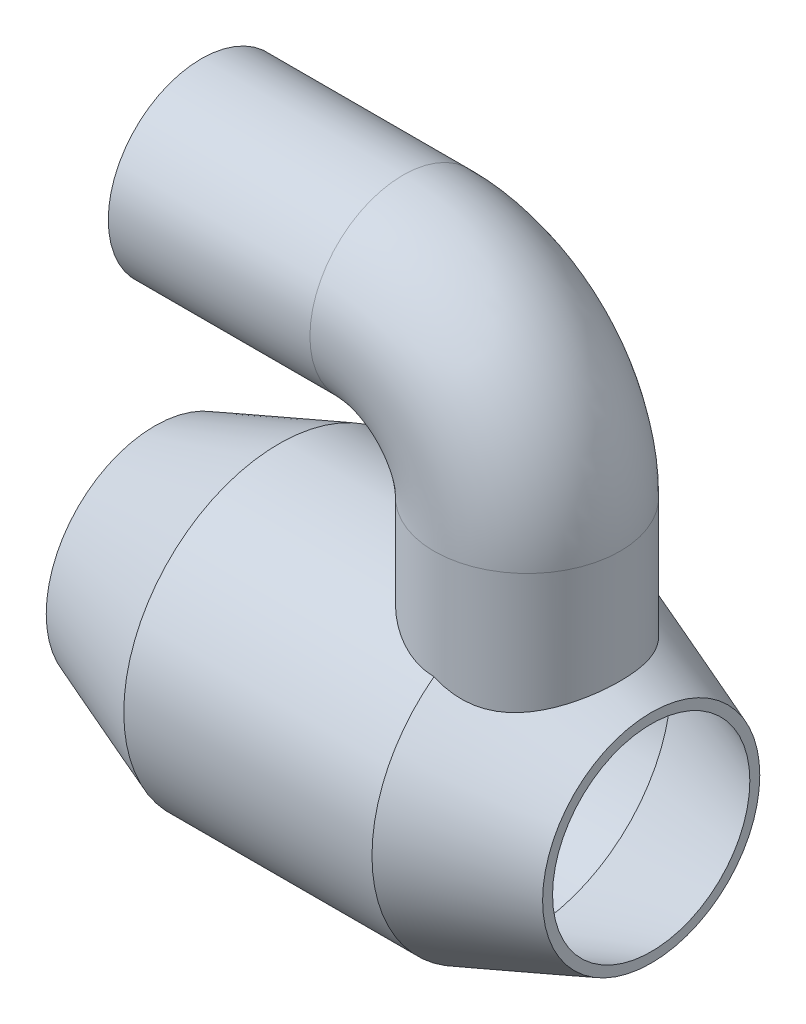
ISO-10303-21;
HEADER;
FILE_DESCRIPTION(('STEP AP214'),'2;1');
FILE_NAME('part.step','',(''),(''),'','','');
FILE_SCHEMA(('AUTOMOTIVE_DESIGN { 1 0 10303 214 1 1 1 1 }'));
ENDSEC;
DATA;
#1=APPLICATION_CONTEXT('core data for automotive mechanical design processes');
#2=APPLICATION_PROTOCOL_DEFINITION('international standard','automotive_design',2000,#1);
#3=PRODUCT_CONTEXT('',#1,'mechanical');
#4=PRODUCT('Part','Part','',(#3));
#5=PRODUCT_RELATED_PRODUCT_CATEGORY('part','',(#4));
#6=PRODUCT_DEFINITION_FORMATION('','',#4);
#7=PRODUCT_DEFINITION_CONTEXT('part definition',#1,'design');
#8=PRODUCT_DEFINITION('design','',#6,#7);
#9=PRODUCT_DEFINITION_SHAPE('','',#8);
#10=(LENGTH_UNIT() NAMED_UNIT(*) SI_UNIT(.MILLI.,.METRE.));
#11=(NAMED_UNIT(*) PLANE_ANGLE_UNIT() SI_UNIT($,.RADIAN.));
#12=(NAMED_UNIT(*) SI_UNIT($,.STERADIAN.) SOLID_ANGLE_UNIT());
#13=UNCERTAINTY_MEASURE_WITH_UNIT(LENGTH_MEASURE(1.E-05),#10,'distance_accuracy_value','');
#14=(GEOMETRIC_REPRESENTATION_CONTEXT(3) GLOBAL_UNCERTAINTY_ASSIGNED_CONTEXT((#13)) GLOBAL_UNIT_ASSIGNED_CONTEXT((#10,
#11,#12)) REPRESENTATION_CONTEXT('',''));
#15=CARTESIAN_POINT('',(0.,0.,0.));
#16=DIRECTION('',(0.,0.,1.));
#17=DIRECTION('',(1.,0.,0.));
#18=AXIS2_PLACEMENT_3D('',#15,#16,#17);
#19=CARTESIAN_POINT('',(80.,0.,0.));
#20=DIRECTION('',(-1.,0.,0.));
#21=DIRECTION('',(0.,0.,1.));
#22=AXIS2_PLACEMENT_3D('',#19,#20,#21);
#23=CONICAL_SURFACE('',#22,35.,0.358770670270572);
#24=CARTESIAN_POINT('',(80.,0.,0.));
#25=DIRECTION('',(-1.,0.,0.));
#26=DIRECTION('',(0.,0.,1.));
#27=AXIS2_PLACEMENT_3D('',#24,#25,#26);
#28=CIRCLE('',#27,35.);
#29=CARTESIAN_POINT('',(80.,0.,35.));
#30=VERTEX_POINT('',#29);
#31=EDGE_CURVE('E49',#30,#30,#28,.T.);
#32=ORIENTED_EDGE('',*,*,#31,.T.);
#33=EDGE_LOOP('',(#32));
#34=FACE_BOUND('',#33,.T.);
#35=CARTESIAN_POINT('',(39.9998,40.0000937504605,29.9999999993333));
#36=CARTESIAN_POINT('',(40.323096188011,39.8485477698529,29.9999991944932));
#37=CARTESIAN_POINT('',(40.6477604137894,39.6999696471568,29.9947776225283));
#38=CARTESIAN_POINT('',(41.2996605350347,39.4092535207293,29.9736103136749));
#39=CARTESIAN_POINT('',(41.626896759719,39.2671163577328,29.957663181064));
#40=CARTESIAN_POINT('',(42.6126358544597,38.8509507532919,29.8932757110898));
#41=CARTESIAN_POINT('',(43.2746309489505,38.5874219082275,29.8282883499882));
#42=CARTESIAN_POINT('',(44.6058325568533,38.0924319865128,29.651946151665));
#43=CARTESIAN_POINT('',(45.2750499752684,37.8610299606478,29.5405073999668));
#44=CARTESIAN_POINT('',(46.6152865375449,37.4349622340986,29.2695248885259));
#45=CARTESIAN_POINT('',(47.2863049729262,37.240283770188,29.109997892055));
#46=CARTESIAN_POINT('',(48.6296234591975,36.8896346125872,28.7405270941269));
#47=CARTESIAN_POINT('',(49.301903584151,36.7339232225839,28.5302629354244));
#48=CARTESIAN_POINT('',(50.6374411563098,36.4646829454509,28.0596878625612));
#49=CARTESIAN_POINT('',(51.3006978237388,36.3511576818737,27.7993726522073));
#50=CARTESIAN_POINT('',(52.6103437550198,36.1664983229699,27.2302747491758));
#51=CARTESIAN_POINT('',(53.256767354836,36.0952701997686,26.92160150474));
#52=CARTESIAN_POINT('',(54.5282283983598,35.9928331879588,26.25728538656));
#53=CARTESIAN_POINT('',(55.1532666788639,35.9616227317323,25.9016443532938));
#54=CARTESIAN_POINT('',(56.3320344732557,35.9364256172987,25.1735798443616));
#55=CARTESIAN_POINT('',(56.8876414618913,35.9398924890538,24.8042671435136));
#56=CARTESIAN_POINT('',(57.9724039540222,35.9740148011757,24.0299138530108));
#57=CARTESIAN_POINT('',(58.5015607067278,36.0046689562384,23.6248749531605));
#58=CARTESIAN_POINT('',(59.5313469305901,36.0886618185986,22.7809214280705));
#59=CARTESIAN_POINT('',(60.0319364030324,36.1420314882667,22.3419612372947));
#60=CARTESIAN_POINT('',(61.001734851296,36.2666412562169,21.4328925419033));
#61=CARTESIAN_POINT('',(61.4709399642187,36.3378835492173,20.9627802170962));
#62=CARTESIAN_POINT('',(62.1779475410738,36.4593523462047,20.2058818742253));
#63=CARTESIAN_POINT('',(62.427142062612,36.5051283184993,19.9289211527566));
#64=CARTESIAN_POINT('',(62.9147304315616,36.5999593892622,19.3663024593839));
#65=CARTESIAN_POINT('',(63.1531265387011,36.649013796301,19.0806463282392));
#66=CARTESIAN_POINT('',(63.8518805702837,36.7998967941208,18.2110080157486));
#67=CARTESIAN_POINT('',(64.2958139863507,36.9054469017289,17.6143454370342));
#68=CARTESIAN_POINT('',(65.1379396998891,37.1202866475325,16.3901248067506));
#69=CARTESIAN_POINT('',(65.5361224149791,37.2295770629286,15.7625603220245));
#70=CARTESIAN_POINT('',(66.2849894020835,37.4462724745604,14.4793372712646));
#71=CARTESIAN_POINT('',(66.6356708723237,37.5536773592567,13.8236770510551));
#72=CARTESIAN_POINT('',(67.3332576310755,37.7760255901965,12.3939786642108));
#73=CARTESIAN_POINT('',(67.6728210240483,37.8899324629998,11.6161802255454));
#74=CARTESIAN_POINT('',(68.2854441041205,38.1021754973165,10.0326664838901));
#75=CARTESIAN_POINT('',(68.558498152916,38.2005103384698,9.22694882066772));
#76=CARTESIAN_POINT('',(69.0355943021337,38.3761627041898,7.59329238994931));
#77=CARTESIAN_POINT('',(69.239655620043,38.4534860801868,6.76535987972602));
#78=CARTESIAN_POINT('',(69.5767840004904,38.5829663714377,5.0932416559649));
#79=CARTESIAN_POINT('',(69.7098561863543,38.6351251028122,4.24905711990224));
#80=CARTESIAN_POINT('',(69.8997821697232,38.7100115585467,2.58410544404681));
#81=CARTESIAN_POINT('',(69.9593920867509,38.7338023675749,1.76370005366075));
#82=CARTESIAN_POINT('',(70.0110178656205,38.7543910202054,0.120425777186514));
#83=CARTESIAN_POINT('',(70.0030349861703,38.7511893664593,-0.702443062742234));
#84=CARTESIAN_POINT('',(69.9195728715253,38.7179541231562,-2.34404139606958));
#85=CARTESIAN_POINT('',(69.8441057718196,38.6879253578408,-3.162771607086));
#86=CARTESIAN_POINT('',(69.6265094276008,38.6025266633736,-4.78995923223832));
#87=CARTESIAN_POINT('',(69.4843810329324,38.5471570572846,-5.59841677720235));
#88=CARTESIAN_POINT('',(69.1423370452146,38.4166605911533,-7.16516918927519));
#89=CARTESIAN_POINT('',(68.9451301785002,38.342472043064,-7.92413674010358));
#90=CARTESIAN_POINT('',(68.4925962324113,38.1767922328763,-9.42255126495677));
#91=CARTESIAN_POINT('',(68.2372709669318,38.0853015107998,-10.1619988474028));
#92=CARTESIAN_POINT('',(67.6702069978158,37.8892286089053,-11.6176684597936));
#93=CARTESIAN_POINT('',(67.358432031676,37.78463802731,-12.333875209364));
#94=CARTESIAN_POINT('',(66.6805619666129,37.5674903941981,-13.7388524511666));
#95=CARTESIAN_POINT('',(66.3144643287619,37.4549329704566,-14.4276216591161));
#96=CARTESIAN_POINT('',(65.5054394816931,37.2205627346462,-15.8163849363348));
#97=CARTESIAN_POINT('',(65.0591425783009,37.0986108158857,-16.5143950727637));
#98=CARTESIAN_POINT('',(64.1098376173805,36.8600837210242,-17.8718141763705));
#99=CARTESIAN_POINT('',(63.6068240822579,36.7435090657847,-18.5312194057938));
#100=CARTESIAN_POINT('',(62.5468411896983,36.5244224429796,-19.8072623334841));
#101=CARTESIAN_POINT('',(61.989892889076,36.4219050247554,-20.423916562228));
#102=CARTESIAN_POINT('',(60.8248604667575,36.2401671119892,-21.6105561383609));
#103=CARTESIAN_POINT('',(60.2167869510188,36.1609418007448,-22.1805511170545));
#104=CARTESIAN_POINT('',(59.0586505970892,36.0457900507517,-23.1786737107022));
#105=CARTESIAN_POINT('',(58.5158081624614,36.0048480793371,-23.6146133846956));
#106=CARTESIAN_POINT('',(57.4001836950204,35.9511071415578,-24.4482780070547));
#107=CARTESIAN_POINT('',(56.8274050326071,35.9383050139986,-24.8460072431316));
#108=CARTESIAN_POINT('',(55.6565960467526,35.9456236184344,-25.5999011673313));
#109=CARTESIAN_POINT('',(55.0586092862668,35.9656896528156,-25.9561338556911));
#110=CARTESIAN_POINT('',(53.841095322659,36.0423938259845,-26.6252989273694));
#111=CARTESIAN_POINT('',(53.2215684836752,36.0990313468101,-26.9382320422285));
#112=CARTESIAN_POINT('',(51.9646832947559,36.2513900678196,-27.5195747848674));
#113=CARTESIAN_POINT('',(51.3272837409838,36.3472099340938,-27.7878695905731));
#114=CARTESIAN_POINT('',(50.0418289729494,36.5785768711866,-28.2778152962705));
#115=CARTESIAN_POINT('',(49.3937731431946,36.7141262443911,-28.4994634917402));
#116=CARTESIAN_POINT('',(48.0914523003049,37.0241603967066,-28.8962409922212));
#117=CARTESIAN_POINT('',(47.4371780521285,37.1987164002878,-29.0712839000439));
#118=CARTESIAN_POINT('',(46.1287017585987,37.5841142720258,-29.3749897620624));
#119=CARTESIAN_POINT('',(45.4744997202499,37.7949498778612,-29.5036607088077));
#120=CARTESIAN_POINT('',(44.4142975807617,38.1643801913143,-29.6763403349387));
#121=CARTESIAN_POINT('',(44.0069580909295,38.3130304763256,-29.734015638428));
#122=CARTESIAN_POINT('',(43.1947863477775,38.6221878761459,-29.8322069803047));
#123=CARTESIAN_POINT('',(42.7899536514493,38.7826928271577,-29.8727261411064));
#124=CARTESIAN_POINT('',(41.9853969911409,39.1137735941228,-29.9369388778231));
#125=CARTESIAN_POINT('',(41.5856578225343,39.2842972760847,-29.9607124185806));
#126=CARTESIAN_POINT('',(40.7898468891437,39.6351155405226,-29.9922439502692));
#127=CARTESIAN_POINT('',(40.3937751148745,39.8154100977195,-30.0000019826334));
#128=CARTESIAN_POINT('',(39.9998,40.0000937504605,-29.9999999993333));
#129=B_SPLINE_CURVE_WITH_KNOTS('',3,(#35,#36,#37,#38,#39,#40,#41,#42,#43,#44,#45,#46,#47,#48,
#49,#50,#51,#52,#53,#54,#55,#56,#57,#58,#59,#60,#61,#62,#63,#64,#65,#66,#67,#68,#69,#70,#71,#72,
#73,#74,#75,#76,#77,#78,#79,#80,#81,#82,#83,#84,#85,#86,#87,#88,#89,#90,#91,#92,#93,#94,#95,#96,
#97,#98,#99,#100,#101,#102,#103,#104,#105,#106,#107,#108,#109,#110,#111,#112,#113,#114,#115,
#116,#117,#118,#119,#120,#121,#122,#123,#124,#125,#126,#127,#128),.UNSPECIFIED.,.F.,.F.,(4,2,2,
2,2,2,2,2,2,2,2,2,2,2,2,2,2,2,2,2,2,2,2,2,2,2,2,2,2,2,2,2,2,2,2,2,2,2,2,2,2,2,2,2,2,2,4),(0.,
1.07105370542639,2.14224681456538,4.28641376637714,6.4344710607487,8.58178041954578,
10.7430201076091,12.9044453912053,15.0610475940177,17.2175653133563,19.216957349584,
21.2162548677222,23.2182862987443,25.2205636951988,26.3464223812661,27.472044365853,
29.7232451273789,31.9749165416329,34.2267207088379,36.7924469378094,39.3583905995854,
41.923618944077,44.4886621295328,46.9542136278259,49.4197192129033,51.8847815224919,
54.3498124066061,56.7102188199501,59.0705515743099,61.4324059881701,63.7943708249398,
66.3038000619748,68.813471863285,71.3221677770852,73.8303445384313,75.9205279208637,
78.0104764827333,80.0969505849705,82.1833894321959,84.2751148704537,86.3669615513884,
88.4626595290212,90.5579961247036,91.8698422123838,93.181449441609,94.4867501355917,
95.7920474526864),.UNSPECIFIED.);
#130=CARTESIAN_POINT('',(40.,40.,30.));
#131=VERTEX_POINT('',#130);
#132=CARTESIAN_POINT('',(40.,40.,-30.));
#133=VERTEX_POINT('',#132);
#134=EDGE_CURVE('E145',#131,#133,#129,.T.);
#135=ORIENTED_EDGE('',*,*,#134,.F.);
#136=CARTESIAN_POINT('',(40.,0.,0.));
#137=DIRECTION('',(-1.,0.,0.));
#138=DIRECTION('',(0.,0.,1.));
#139=AXIS2_PLACEMENT_3D('',#136,#137,#138);
#140=CIRCLE('',#139,50.);
#141=EDGE_CURVE('E56',#133,#131,#140,.T.);
#142=ORIENTED_EDGE('',*,*,#141,.F.);
#143=EDGE_LOOP('',(#135,#142));
#144=FACE_BOUND('',#143,.T.);
#145=ADVANCED_FACE('F35',(#34,#144),#23,.T.);
#146=CARTESIAN_POINT('',(-81.5238095238095,0.,0.));
#147=DIRECTION('',(-1.,0.,0.));
#148=DIRECTION('',(0.,0.,1.));
#149=AXIS2_PLACEMENT_3D('',#146,#147,#148);
#150=CYLINDRICAL_SURFACE('',#149,50.);
#151=CARTESIAN_POINT('',(-40.,0.,0.));
#152=DIRECTION('',(-1.,0.,0.));
#153=DIRECTION('',(0.,0.,1.));
#154=AXIS2_PLACEMENT_3D('',#151,#152,#153);
#155=CIRCLE('',#154,50.);
#156=CARTESIAN_POINT('',(-40.,0.,50.));
#157=VERTEX_POINT('',#156);
#158=EDGE_CURVE('E174',#157,#157,#155,.T.);
#159=ORIENTED_EDGE('',*,*,#158,.F.);
#160=EDGE_LOOP('',(#159));
#161=FACE_BOUND('',#160,.T.);
#162=CARTESIAN_POINT('',(40.,40.,-30.));
#163=CARTESIAN_POINT('',(39.6206756638113,39.9999789473304,-30.0000111796213));
#164=CARTESIAN_POINT('',(39.2413601735257,40.0053952575016,-29.9928058986134));
#165=CARTESIAN_POINT('',(38.483604261773,40.026946872674,-29.964047030844));
#166=CARTESIAN_POINT('',(38.1051637808863,40.0430814270125,-29.9424944489093));
#167=CARTESIAN_POINT('',(37.3503228195508,40.0858933703753,-29.8851529897149));
#168=CARTESIAN_POINT('',(36.9739207349831,40.1125606677222,-29.8493777393256));
#169=CARTESIAN_POINT('',(36.2236150288252,40.1761279483931,-29.7637624255481));
#170=CARTESIAN_POINT('',(35.8497114356699,40.2130280479728,-29.7139222023664));
#171=CARTESIAN_POINT('',(34.7388551818135,40.3378468121823,-29.5445094303421));
#172=CARTESIAN_POINT('',(34.0064918453932,40.4402508636312,-29.4045627990465));
#173=CARTESIAN_POINT('',(32.5596394002035,40.6798380751245,-29.0721947245365));
#174=CARTESIAN_POINT('',(31.8451539137085,40.8170282215683,-28.8797627396357));
#175=CARTESIAN_POINT('',(30.4407816560674,41.1206802675769,-28.4457283539177));
#176=CARTESIAN_POINT('',(29.7508128140926,41.2870306686302,-28.2043127144929));
#177=CARTESIAN_POINT('',(28.395827131279,41.6440813807743,-27.67440107099));
#178=CARTESIAN_POINT('',(27.7308095328911,41.8347809518204,-27.3859064977084));
#179=CARTESIAN_POINT('',(26.4266513546236,42.2356468198328,-26.76354571255));
#180=CARTESIAN_POINT('',(25.7875685746331,42.445853497808,-26.4295846836357));
#181=CARTESIAN_POINT('',(24.5385741905161,42.8802140500297,-25.7188783505331));
#182=CARTESIAN_POINT('',(23.9286658990069,43.1043695014723,-25.3421282041653));
#183=CARTESIAN_POINT('',(22.6674466194287,43.589432147621,-24.4994992991559));
#184=CARTESIAN_POINT('',(22.0200957214403,43.8514978118045,-24.0283528023913));
#185=CARTESIAN_POINT('',(20.7662176892255,44.3803471738467,-23.0369372789398));
#186=CARTESIAN_POINT('',(20.1596929158819,44.6471311434297,-22.5166654156169));
#187=CARTESIAN_POINT('',(18.9895047215692,45.1793017905803,-21.4288912012014));
#188=CARTESIAN_POINT('',(18.4258548319477,45.4446880026209,-20.8613740568429));
#189=CARTESIAN_POINT('',(17.3441111021582,45.9680896243412,-19.6812465606455));
#190=CARTESIAN_POINT('',(16.8260195612914,46.2261046615593,-19.0686339357293));
#191=CARTESIAN_POINT('',(15.7846649348936,46.7563941532387,-17.7316424765263));
#192=CARTESIAN_POINT('',(15.2669307437779,47.027181875609,-17.0023470457018));
#193=CARTESIAN_POINT('',(14.2953420559524,47.5453528537253,-15.4943554772178));
#194=CARTESIAN_POINT('',(13.8414933917569,47.7927339718591,-14.7156548384468));
#195=CARTESIAN_POINT('',(13.0028631631441,48.2568492131762,-13.1137822817021));
#196=CARTESIAN_POINT('',(12.618037305967,48.4736029712124,-12.2906393273659));
#197=CARTESIAN_POINT('',(11.9222185767319,48.8700317337954,-10.6051415627172));
#198=CARTESIAN_POINT('',(11.6112135635852,49.0497128349324,-9.74279322823061));
#199=CARTESIAN_POINT('',(11.0937970637078,49.3510765131636,-8.06989524858028));
#200=CARTESIAN_POINT('',(10.8802359877021,49.4766578246496,-7.26225704809539));
#201=CARTESIAN_POINT('',(10.5205730278738,49.6891890382529,-5.62707249214012));
#202=CARTESIAN_POINT('',(10.3744672329504,49.7761411801035,-4.79952729381821));
#203=CARTESIAN_POINT('',(10.1521488595477,49.9087794117772,-3.13247163366586));
#204=CARTESIAN_POINT('',(10.0758817038621,49.9544977244181,-2.29297103664966));
#205=CARTESIAN_POINT('',(9.99435373309587,50.0033768057683,-0.609324513566647));
#206=CARTESIAN_POINT('',(9.98908569384441,50.0065419042735,0.234820931142112));
#207=CARTESIAN_POINT('',(10.0458450530288,49.9725033115231,1.81489678130835));
#208=CARTESIAN_POINT('',(10.0995979788354,49.9402631859136,2.55124963558446));
#209=CARTESIAN_POINT('',(10.2608763603904,49.8438689245956,4.01586380799762));
#210=CARTESIAN_POINT('',(10.3683962760448,49.7797180769379,4.74412595189163));
#211=CARTESIAN_POINT('',(10.6358578453943,49.620976245626,6.18756963043452));
#212=CARTESIAN_POINT('',(10.7958011679814,49.5263842928851,6.90275074788534));
#213=CARTESIAN_POINT('',(11.1662338443863,49.3088593194398,8.31548239854251));
#214=CARTESIAN_POINT('',(11.3767252805034,49.1859251312022,9.01303220412877));
#215=CARTESIAN_POINT('',(11.8473452126073,48.9135456640161,10.3904171383862));
#216=CARTESIAN_POINT('',(12.1077505167097,48.763952885524,11.0701282409173));
#217=CARTESIAN_POINT('',(12.6749101670539,48.4417802847179,12.4042288074662));
#218=CARTESIAN_POINT('',(12.9816640805432,48.2692006770315,13.0586185078358));
#219=CARTESIAN_POINT('',(13.6390112689519,47.9043523411637,14.3393321430713));
#220=CARTESIAN_POINT('',(13.9896093668262,47.7120814473203,14.9656529799896));
#221=CARTESIAN_POINT('',(14.7321471100885,47.3113801756583,16.1878659416029));
#222=CARTESIAN_POINT('',(15.1240893391623,47.1029487881508,16.7837561611639));
#223=CARTESIAN_POINT('',(15.9961160930998,46.6479581242098,18.0124056657785));
#224=CARTESIAN_POINT('',(16.48113751666,46.3998170402888,18.6410792351707));
#225=CARTESIAN_POINT('',(17.4971274610812,45.8931951245356,19.8556726480506));
#226=CARTESIAN_POINT('',(18.0280991541289,45.634713579511,20.4415895346667));
#227=CARTESIAN_POINT('',(19.1342414874116,45.1125456557183,21.5695392543035));
#228=CARTESIAN_POINT('',(19.7094785717901,44.8488519121335,22.1115035058708));
#229=CARTESIAN_POINT('',(20.9011608570531,44.3224535970394,23.1486144104797));
#230=CARTESIAN_POINT('',(21.5176079926481,44.0597490725839,23.6437588628083));
#231=CARTESIAN_POINT('',(22.8640130812529,43.5111610285403,24.6401890430576));
#232=CARTESIAN_POINT('',(23.5988182688336,43.226155468953,25.1354332107847));
#233=CARTESIAN_POINT('',(25.1145097511904,42.6741113737994,26.0616776101849));
#234=CARTESIAN_POINT('',(25.8954034001509,42.4070757202601,26.4926675501245));
#235=CARTESIAN_POINT('',(27.4972966070838,41.9015739332898,27.2851307993415));
#236=CARTESIAN_POINT('',(28.3181603547804,41.6630194245816,27.6468213712513));
#237=CARTESIAN_POINT('',(29.9977790278494,41.2236410467785,28.2978076441935));
#238=CARTESIAN_POINT('',(30.8565201374145,41.0228035586199,28.5871294890872));
#239=CARTESIAN_POINT('',(32.3918958485676,40.711963168597,29.0273965269192));
#240=CARTESIAN_POINT('',(33.0617715117507,40.5917557282054,29.194879741158));
#241=CARTESIAN_POINT('',(34.4161019851371,40.3823367439259,29.4838757686022));
#242=CARTESIAN_POINT('',(35.1005519090495,40.2931149799073,29.6054037405879));
#243=CARTESIAN_POINT('',(36.1371392768045,40.1846012693714,29.7523346735888));
#244=CARTESIAN_POINT('',(36.4855525309648,40.1525829987797,29.7955061309818));
#245=CARTESIAN_POINT('',(37.1843986796879,40.097460725077,29.8696468674461));
#246=CARTESIAN_POINT('',(37.5348315507661,40.074356618522,29.9006162881153));
#247=CARTESIAN_POINT('',(38.2373667764824,40.0372799082532,29.9502458033019));
#248=CARTESIAN_POINT('',(38.5894703589356,40.0233156224846,29.968894685319));
#249=CARTESIAN_POINT('',(39.2943803651208,40.0046675319604,29.9937763046965));
#250=CARTESIAN_POINT('',(39.6471868270175,39.9999842456954,30.0000083483802));
#251=CARTESIAN_POINT('',(40.,40.,30.));
#252=B_SPLINE_CURVE_WITH_KNOTS('',3,(#162,#163,#164,#165,#166,#167,#168,#169,#170,#171,#172,
#173,#174,#175,#176,#177,#178,#179,#180,#181,#182,#183,#184,#185,#186,#187,#188,#189,#190,#191,
#192,#193,#194,#195,#196,#197,#198,#199,#200,#201,#202,#203,#204,#205,#206,#207,#208,#209,#210,
#211,#212,#213,#214,#215,#216,#217,#218,#219,#220,#221,#222,#223,#224,#225,#226,#227,#228,#229,
#230,#231,#232,#233,#234,#235,#236,#237,#238,#239,#240,#241,#242,#243,#244,#245,#246,#247,#248,
#249,#250,#251),.UNSPECIFIED.,.F.,.F.,(4,2,2,2,2,2,2,2,2,2,2,2,2,2,2,2,2,2,2,2,2,2,2,2,2,2,2,2,
2,2,2,2,2,2,2,2,2,2,2,2,2,2,2,2,4),(0.,1.13785053589824,2.27562138973319,3.41230475182638,
4.54900102839579,6.80358166233318,9.05861546280672,11.3052077563995,13.5517317855316,
15.8030146685794,18.0545525696931,20.5793759529404,23.1043452158138,25.6301080829031,
28.1559983505811,30.9557334062647,33.7557239019407,36.5539111311683,39.3516378317159,
41.8823455626011,44.4129065429822,46.9414882593129,49.4698126901291,51.6842095689373,
53.8983783256268,56.1126175769233,58.3269480581364,60.553933776861,62.7808987037207,
65.0081088173763,67.2354581968499,69.7285978910834,72.2219098372605,74.7190402230967,
77.2162879255022,80.005304931329,82.7947681809835,85.5753376227619,88.354901103007,
90.455466965914,92.555339331222,93.6126731593579,94.6699947173655,95.728277186868,
96.7866187765123),.UNSPECIFIED.);
#253=EDGE_CURVE('E11',#133,#131,#252,.T.);
#254=ORIENTED_EDGE('',*,*,#253,.F.);
#255=ORIENTED_EDGE('',*,*,#141,.T.);
#256=EDGE_LOOP('',(#254,#255));
#257=FACE_BOUND('',#256,.T.);
#258=ADVANCED_FACE('F131',(#161,#257),#150,.T.);
#259=CARTESIAN_POINT('',(-80.,35.,0.));
#260=DIRECTION('',(1.,0.,0.));
#261=DIRECTION('',(0.,0.,-1.));
#262=AXIS2_PLACEMENT_3D('',#259,#260,#261);
#263=PLANE('',#262);
#264=CARTESIAN_POINT('',(-80.,0.,0.));
#265=DIRECTION('',(1.,0.,0.));
#266=DIRECTION('',(0.,0.,-1.));
#267=AXIS2_PLACEMENT_3D('',#264,#265,#266);
#268=CIRCLE('',#267,31.7959985955059);
#269=CARTESIAN_POINT('',(-80.,0.,-31.7959985955059));
#270=VERTEX_POINT('',#269);
#271=EDGE_CURVE('E78',#270,#270,#268,.F.);
#272=ORIENTED_EDGE('',*,*,#271,.F.);
#273=EDGE_LOOP('',(#272));
#274=FACE_BOUND('',#273,.T.);
#275=CARTESIAN_POINT('',(-80.,0.,0.));
#276=DIRECTION('',(-1.,0.,0.));
#277=DIRECTION('',(0.,0.,1.));
#278=AXIS2_PLACEMENT_3D('',#275,#276,#277);
#279=CIRCLE('',#278,35.);
#280=CARTESIAN_POINT('',(-80.,0.,35.));
#281=VERTEX_POINT('',#280);
#282=EDGE_CURVE('E153',#281,#281,#279,.T.);
#283=ORIENTED_EDGE('',*,*,#282,.T.);
#284=EDGE_LOOP('',(#283));
#285=FACE_BOUND('',#284,.T.);
#286=ADVANCED_FACE('F37',(#274,#285),#263,.F.);
#287=CARTESIAN_POINT('',(80.,0.,0.));
#288=DIRECTION('',(-1.,0.,0.));
#289=DIRECTION('',(0.,0.,1.));
#290=AXIS2_PLACEMENT_3D('',#287,#288,#289);
#291=PLANE('',#290);
#292=CARTESIAN_POINT('',(80.,0.,0.));
#293=DIRECTION('',(-1.,0.,0.));
#294=DIRECTION('',(0.,0.,1.));
#295=AXIS2_PLACEMENT_3D('',#292,#293,#294);
#296=CIRCLE('',#295,31.7959985955059);
#297=CARTESIAN_POINT('',(80.,0.,31.7959985955059));
#298=VERTEX_POINT('',#297);
#299=EDGE_CURVE('E72',#298,#298,#296,.T.);
#300=ORIENTED_EDGE('',*,*,#299,.T.);
#301=EDGE_LOOP('',(#300));
#302=FACE_BOUND('',#301,.T.);
#303=ORIENTED_EDGE('',*,*,#31,.F.);
#304=EDGE_LOOP('',(#303));
#305=FACE_BOUND('',#304,.T.);
#306=ADVANCED_FACE('F143',(#302,#305),#291,.F.);
#307=CARTESIAN_POINT('',(-40.,0.,0.));
#308=DIRECTION('',(1.,0.,0.));
#309=DIRECTION('',(0.,0.,-1.));
#310=AXIS2_PLACEMENT_3D('',#307,#308,#309);
#311=CONICAL_SURFACE('',#310,50.,0.358770670270572);
#312=ORIENTED_EDGE('',*,*,#282,.F.);
#313=EDGE_LOOP('',(#312));
#314=FACE_BOUND('',#313,.T.);
#315=ORIENTED_EDGE('',*,*,#158,.T.);
#316=EDGE_LOOP('',(#315));
#317=FACE_BOUND('',#316,.T.);
#318=ADVANCED_FACE('F159',(#314,#317),#311,.T.);
#319=CARTESIAN_POINT('',(40.,75.,0.));
#320=DIRECTION('',(0.,-1.,0.));
#321=DIRECTION('',(1.,0.,0.));
#322=AXIS2_PLACEMENT_3D('',#319,#320,#321);
#323=CYLINDRICAL_SURFACE('',#322,30.);
#324=CARTESIAN_POINT('',(40.,75.,0.));
#325=DIRECTION('',(0.,1.,0.));
#326=DIRECTION('',(0.,0.,1.));
#327=AXIS2_PLACEMENT_3D('',#324,#325,#326);
#328=CIRCLE('',#327,30.);
#329=CARTESIAN_POINT('',(70.,75.,0.));
#330=VERTEX_POINT('',#329);
#331=EDGE_CURVE('E154',#330,#330,#328,.T.);
#332=ORIENTED_EDGE('',*,*,#331,.F.);
#333=EDGE_LOOP('',(#332));
#334=FACE_BOUND('',#333,.T.);
#335=ORIENTED_EDGE('',*,*,#253,.T.);
#336=ORIENTED_EDGE('',*,*,#134,.T.);
#337=EDGE_LOOP('',(#335,#336));
#338=FACE_BOUND('',#337,.T.);
#339=ADVANCED_FACE('F125',(#334,#338),#323,.T.);
#340=CARTESIAN_POINT('',(-65.,115.,0.));
#341=DIRECTION('',(-1.,0.,0.));
#342=DIRECTION('',(0.,0.,1.));
#343=AXIS2_PLACEMENT_3D('',#340,#341,#342);
#344=PLANE('',#343);
#345=CARTESIAN_POINT('',(-65.,115.,0.));
#346=DIRECTION('',(-1.,0.,0.));
#347=DIRECTION('',(0.,-1.,0.));
#348=AXIS2_PLACEMENT_3D('',#345,#346,#347);
#349=CIRCLE('',#348,27.);
#350=CARTESIAN_POINT('',(-65.,88.,0.));
#351=VERTEX_POINT('',#350);
#352=EDGE_CURVE('E189',#351,#351,#349,.T.);
#353=ORIENTED_EDGE('',*,*,#352,.F.);
#354=EDGE_LOOP('',(#353));
#355=FACE_BOUND('',#354,.T.);
#356=CARTESIAN_POINT('',(-65.,115.,0.));
#357=DIRECTION('',(-1.,0.,0.));
#358=DIRECTION('',(0.,0.,1.));
#359=AXIS2_PLACEMENT_3D('',#356,#357,#358);
#360=CIRCLE('',#359,30.);
#361=CARTESIAN_POINT('',(-65.,115.,30.));
#362=VERTEX_POINT('',#361);
#363=EDGE_CURVE('E82',#362,#362,#360,.T.);
#364=ORIENTED_EDGE('',*,*,#363,.T.);
#365=EDGE_LOOP('',(#364));
#366=FACE_BOUND('',#365,.T.);
#367=ADVANCED_FACE('F116',(#355,#366),#344,.T.);
#368=CARTESIAN_POINT('',(-65.,115.,0.));
#369=DIRECTION('',(1.,0.,0.));
#370=DIRECTION('',(0.,1.,0.));
#371=AXIS2_PLACEMENT_3D('',#368,#369,#370);
#372=CYLINDRICAL_SURFACE('',#371,30.);
#373=CARTESIAN_POINT('',(0.,115.,0.));
#374=DIRECTION('',(-1.,0.,0.));
#375=DIRECTION('',(0.,0.,1.));
#376=AXIS2_PLACEMENT_3D('',#373,#374,#375);
#377=CIRCLE('',#376,30.);
#378=CARTESIAN_POINT('',(0.,145.,0.));
#379=VERTEX_POINT('',#378);
#380=EDGE_CURVE('E85',#379,#379,#377,.T.);
#381=ORIENTED_EDGE('',*,*,#380,.T.);
#382=EDGE_LOOP('',(#381));
#383=FACE_BOUND('',#382,.T.);
#384=ORIENTED_EDGE('',*,*,#363,.F.);
#385=EDGE_LOOP('',(#384));
#386=FACE_BOUND('',#385,.T.);
#387=ADVANCED_FACE('F122',(#383,#386),#372,.T.);
#388=CARTESIAN_POINT('',(0.,75.,0.));
#389=DIRECTION('',(0.,0.,-1.));
#390=DIRECTION('',(-1.,0.,0.));
#391=AXIS2_PLACEMENT_3D('',#388,#389,#390);
#392=TOROIDAL_SURFACE('',#391,40.,30.);
#393=CARTESIAN_POINT('',(0.,75.,0.));
#394=DIRECTION('',(0.,0.,-1.));
#395=DIRECTION('',(-1.,0.,0.));
#396=AXIS2_PLACEMENT_3D('',#393,#394,#395);
#397=CIRCLE('',#396,70.);
#398=EDGE_CURVE('',#379,#330,#397,.T.);
#399=ORIENTED_EDGE('',*,*,#380,.F.);
#400=ORIENTED_EDGE('',*,*,#331,.T.);
#401=ORIENTED_EDGE('',*,*,#398,.T.);
#402=ORIENTED_EDGE('',*,*,#398,.F.);
#403=EDGE_LOOP('',(#399,#401,#400,#402));
#404=FACE_BOUND('',#403,.T.);
#405=ADVANCED_FACE('F114',(#404),#392,.T.);
#406=CARTESIAN_POINT('',(78.9466296752348,0.,0.));
#407=DIRECTION('',(-1.,0.,0.));
#408=DIRECTION('',(0.,0.,1.));
#409=AXIS2_PLACEMENT_3D('',#406,#407,#408);
#410=CONICAL_SURFACE('',#409,32.1910124672929,0.358770670270572);
#411=ORIENTED_EDGE('',*,*,#299,.F.);
#412=EDGE_LOOP('',(#411));
#413=FACE_BOUND('',#412,.T.);
#414=CARTESIAN_POINT('',(39.4559962546825,38.4746142290591,26.9945190719353));
#415=CARTESIAN_POINT('',(40.0551822906927,38.191595816653,27.006604776098));
#416=CARTESIAN_POINT('',(40.6599364718713,37.9189121558083,26.9988201556693));
#417=CARTESIAN_POINT('',(41.8785944745737,37.3979030387282,26.9414788873725));
#418=CARTESIAN_POINT('',(42.4925070904479,37.1496029979571,26.891879160204));
#419=CARTESIAN_POINT('',(43.7277349023818,36.6810862324707,26.7486707181268));
#420=CARTESIAN_POINT('',(44.3490643717898,36.4609386227645,26.6549562414983));
#421=CARTESIAN_POINT('',(45.5936672750905,36.0532093798155,26.4218003241679));
#422=CARTESIAN_POINT('',(46.2169399891898,35.8656168776565,26.2823741899455));
#423=CARTESIAN_POINT('',(47.4649580343548,35.5248120254208,25.9555974598794));
#424=CARTESIAN_POINT('',(48.0896872524683,35.3718274398809,25.7679457984465));
#425=CARTESIAN_POINT('',(49.3311084554827,35.1036166459226,25.344830264886));
#426=CARTESIAN_POINT('',(49.9477997842189,34.9883935018112,25.1093625150359));
#427=CARTESIAN_POINT('',(51.1657130433424,34.7961918819867,24.5919410753304));
#428=CARTESIAN_POINT('',(51.7669683327099,34.71912293136,24.3100994887484));
#429=CARTESIAN_POINT('',(52.9497531387749,34.6013132431622,23.7011875144782));
#430=CARTESIAN_POINT('',(53.531283629209,34.5605707097786,23.3741193635085));
#431=CARTESIAN_POINT('',(54.6251137430693,34.5141528910861,22.7042916067139));
#432=CARTESIAN_POINT('',(55.1392790994555,34.5059952829992,22.3647341074104));
#433=CARTESIAN_POINT('',(56.1429951831749,34.5144917925759,21.6513915252266));
#434=CARTESIAN_POINT('',(56.6325471444728,34.5311446651094,21.2776081608772));
#435=CARTESIAN_POINT('',(57.58487536061,34.5853114609352,20.4975997744783));
#436=CARTESIAN_POINT('',(58.0476148509788,34.6228533125689,20.0913319450745));
#437=CARTESIAN_POINT('',(58.9434646055202,34.7145316317264,19.2489786871417));
#438=CARTESIAN_POINT('',(59.376571466227,34.7686700015485,18.8128898449728));
#439=CARTESIAN_POINT('',(60.0237913303579,34.862119957308,18.1152458698911));
#440=CARTESIAN_POINT('',(60.2489202014746,34.8971748973261,17.8632379798893));
#441=CARTESIAN_POINT('',(60.6893110815068,34.9702816855497,17.3512649901479));
#442=CARTESIAN_POINT('',(60.9045752357301,35.008332877212,17.0913016412111));
#443=CARTESIAN_POINT('',(61.5353242416936,35.1259513144295,16.2998443932181));
#444=CARTESIAN_POINT('',(61.9357792029427,35.208985459495,15.7567686613593));
#445=CARTESIAN_POINT('',(62.694695235941,35.3789581103742,14.6425857956129));
#446=CARTESIAN_POINT('',(63.0531501408591,35.4658971869596,14.0714745627221));
#447=CARTESIAN_POINT('',(63.7264296603297,35.6388078355712,12.9039014981139));
#448=CARTESIAN_POINT('',(64.0412518361035,35.7247793532709,12.3074382518206));
#449=CARTESIAN_POINT('',(64.6628140648088,35.9019473275616,11.0146819905977));
#450=CARTESIAN_POINT('',(64.9634391441969,35.9924186830745,10.3153372816252));
#451=CARTESIAN_POINT('',(65.5049971254141,36.1610596201846,8.89239398740345));
#452=CARTESIAN_POINT('',(65.7459254163624,36.2392282513699,8.16879353357809));
#453=CARTESIAN_POINT('',(66.1659938976072,36.3787244950137,6.70240793730382));
#454=CARTESIAN_POINT('',(66.3451464419858,36.4400554742112,5.95962666266196));
#455=CARTESIAN_POINT('',(66.6400117531121,36.542430539675,4.46021071849425));
#456=CARTESIAN_POINT('',(66.7557282415686,36.5834758160625,3.70357686437281));
#457=CARTESIAN_POINT('',(66.9200982164216,36.6421298078286,2.2045660544003));
#458=CARTESIAN_POINT('',(66.9706121201902,36.6603881677808,1.4624183515759));
#459=CARTESIAN_POINT('',(67.0102194339721,36.6746864417879,-0.0237298092098063));
#460=CARTESIAN_POINT('',(66.9993136159401,36.6707266350923,-0.767730243767546));
#461=CARTESIAN_POINT('',(66.9162022696227,36.640797589615,-2.25173110075543));
#462=CARTESIAN_POINT('',(66.8440057699106,36.6148315925098,-2.99173209617608));
#463=CARTESIAN_POINT('',(66.639057962102,36.5422534376765,-4.46225300158264));
#464=CARTESIAN_POINT('',(66.5063072541,36.4956414845506,-5.19277300545177));
#465=CARTESIAN_POINT('',(66.1872429523919,36.3861943541858,-6.61359989639741));
#466=CARTESIAN_POINT('',(66.0029782288915,36.3239876701509,-7.30441732455307));
#467=CARTESIAN_POINT('',(65.5807634270032,36.1857487537027,-8.66798377163693));
#468=CARTESIAN_POINT('',(65.3428148022199,36.1097168956459,-9.34073327924027));
#469=CARTESIAN_POINT('',(64.814793357692,35.9476693386088,-10.6646246003868));
#470=CARTESIAN_POINT('',(64.5246917981933,35.8616481441367,-11.3157542643826));
#471=CARTESIAN_POINT('',(63.8942702981106,35.6842670251158,-12.5924892830377));
#472=CARTESIAN_POINT('',(63.5539477834107,35.592906827057,-13.2180933272612));
#473=CARTESIAN_POINT('',(62.8052103301331,35.4051611622409,-14.4736011378073));
#474=CARTESIAN_POINT('',(62.3941056697154,35.308771530862,-15.1019024735896));
#475=CARTESIAN_POINT('',(61.5204537141997,35.1227957821655,-16.3227928172007));
#476=CARTESIAN_POINT('',(61.0579040375917,35.0332099801362,-16.9153801697862));
#477=CARTESIAN_POINT('',(60.0838807036503,34.8683668669736,-18.0610911832054));
#478=CARTESIAN_POINT('',(59.5724075737893,34.7931094013841,-18.6142152694034));
#479=CARTESIAN_POINT('',(58.5035449854492,34.664876618692,-19.677060978789));
#480=CARTESIAN_POINT('',(57.9461573533183,34.6119004158154,-20.186784326696));
#481=CARTESIAN_POINT('',(56.7936038136393,34.5365169177559,-21.155071305267));
#482=CARTESIAN_POINT('',(56.1987488011177,34.5138857875065,-21.6139863756931));
#483=CARTESIAN_POINT('',(54.9725894374247,34.5057637607579,-22.4807715035347));
#484=CARTESIAN_POINT('',(54.3412861115288,34.5202718200461,-22.8886429957633));
#485=CARTESIAN_POINT('',(53.049759547826,34.592324346784,-23.6487679710237));
#486=CARTESIAN_POINT('',(52.3895879486945,34.64979470881,-24.0011159605656));
#487=CARTESIAN_POINT('',(51.0470309633125,34.8114813902603,-24.6478808847207));
#488=CARTESIAN_POINT('',(50.3646497062914,34.9156890657874,-24.9423085170157));
#489=CARTESIAN_POINT('',(49.0913047240562,35.1523080658346,-25.431081470976));
#490=CARTESIAN_POINT('',(48.5022895993335,35.2779845071639,-25.6338438265925));
#491=CARTESIAN_POINT('',(47.3191673645252,35.5627534972554,-25.9963944020556));
#492=CARTESIAN_POINT('',(46.7250604240971,35.721844936761,-26.1561840480384));
#493=CARTESIAN_POINT('',(45.5357423239699,36.0715686444536,-26.4334795414959));
#494=CARTESIAN_POINT('',(44.9405306526378,36.2622285434533,-26.5509480580959));
#495=CARTESIAN_POINT('',(43.7534437391352,36.6720670679424,-26.7445940563442));
#496=CARTESIAN_POINT('',(43.1615677871861,36.891239367534,-26.8207806776824));
#497=CARTESIAN_POINT('',(42.0462968744573,37.3302748425968,-26.927540693918));
#498=CARTESIAN_POINT('',(41.5222800181538,37.547613124446,-26.9620861993494));
#499=CARTESIAN_POINT('',(40.742288194586,37.8863801914614,-26.9910423981329));
#500=CARTESIAN_POINT('',(40.4837938942102,38.0011933174057,-26.9968948097455));
#501=CARTESIAN_POINT('',(39.9685471673435,38.234911624707,-27.0012105973762));
#502=CARTESIAN_POINT('',(39.7117950338879,38.3538174749954,-26.999672759754));
#503=CARTESIAN_POINT('',(39.4559962546825,38.4746142290591,-26.9945190719353));
#504=B_SPLINE_CURVE_WITH_KNOTS('',3,(#414,#415,#416,#417,#418,#419,#420,#421,#422,#423,#424,
#425,#426,#427,#428,#429,#430,#431,#432,#433,#434,#435,#436,#437,#438,#439,#440,#441,#442,#443,
#444,#445,#446,#447,#448,#449,#450,#451,#452,#453,#454,#455,#456,#457,#458,#459,#460,#461,#462,
#463,#464,#465,#466,#467,#468,#469,#470,#471,#472,#473,#474,#475,#476,#477,#478,#479,#480,#481,
#482,#483,#484,#485,#486,#487,#488,#489,#490,#491,#492,#493,#494,#495,#496,#497,#498,#499,#500,
#501,#502,#503),.UNSPECIFIED.,.F.,.F.,(4,2,2,2,2,2,2,2,2,2,2,2,2,2,2,2,2,2,2,2,2,2,2,2,2,2,2,2,
2,2,2,2,2,2,2,2,2,2,2,2,2,2,2,2,4),(0.,1.98830920650722,3.97866934142703,5.97382570494067,
7.96831467452154,9.97557096408706,11.9829901003826,13.985625973042,15.9881628390257,
17.834853615643,19.6814517180058,21.5305246552618,23.3798096131327,24.3987917649736,
25.4175512539218,27.4550102187268,29.4927679679364,31.5306395683308,33.8275701912084,
36.12467816993,38.4213264999539,40.7178400742589,42.94726337835,45.1766586619624,
47.4057255960402,49.6347704404618,51.7853892906218,53.9359499152362,56.0876992956755,
58.2395590041169,60.5079707456833,62.7764875410663,65.044979880999,67.3133820302913,
69.5649579328451,71.8164705303503,74.0641084421728,76.3113308327954,78.2154643086692,
80.1195345842204,82.0252803249028,83.9306039665191,85.6344065893482,86.483010225575,
87.3317532258165),.UNSPECIFIED.);
#505=CARTESIAN_POINT('',(39.4559962546825,38.4746142290591,26.9945190719353));
#506=VERTEX_POINT('',#505);
#507=CARTESIAN_POINT('',(39.4559962546825,38.4746142290591,-26.9945190719353));
#508=VERTEX_POINT('',#507);
#509=EDGE_CURVE('E69',#506,#508,#504,.T.);
#510=ORIENTED_EDGE('',*,*,#509,.T.);
#511=CARTESIAN_POINT('',(39.4559962546825,0.,0.));
#512=DIRECTION('',(-1.,0.,0.));
#513=DIRECTION('',(0.,0.,1.));
#514=AXIS2_PLACEMENT_3D('',#511,#512,#513);
#515=CIRCLE('',#514,47.);
#516=EDGE_CURVE('E66',#508,#506,#515,.T.);
#517=ORIENTED_EDGE('',*,*,#516,.T.);
#518=EDGE_LOOP('',(#510,#517));
#519=FACE_BOUND('',#518,.T.);
#520=ADVANCED_FACE('F68',(#413,#519),#410,.F.);
#521=CARTESIAN_POINT('',(-81.5238095238095,0.,0.));
#522=DIRECTION('',(-1.,0.,0.));
#523=DIRECTION('',(0.,0.,1.));
#524=AXIS2_PLACEMENT_3D('',#521,#522,#523);
#525=CYLINDRICAL_SURFACE('',#524,47.);
#526=CARTESIAN_POINT('',(-39.4559962546825,0.,0.));
#527=DIRECTION('',(1.,0.,0.));
#528=DIRECTION('',(0.,0.,-1.));
#529=AXIS2_PLACEMENT_3D('',#526,#527,#528);
#530=CIRCLE('',#529,47.);
#531=CARTESIAN_POINT('',(-39.4559962546825,0.,-47.));
#532=VERTEX_POINT('',#531);
#533=EDGE_CURVE('E73',#532,#532,#530,.F.);
#534=ORIENTED_EDGE('',*,*,#533,.T.);
#535=EDGE_LOOP('',(#534));
#536=FACE_BOUND('',#535,.T.);
#537=CARTESIAN_POINT('',(39.4559962546825,38.4746142290591,-26.9945190719353));
#538=CARTESIAN_POINT('',(39.1080710996104,38.4795160420868,-26.9875172494012));
#539=CARTESIAN_POINT('',(38.7603585014033,38.4891681251944,-26.9737713405156));
#540=CARTESIAN_POINT('',(38.0661304642639,38.5177872248728,-26.9328964078833));
#541=CARTESIAN_POINT('',(37.7196149372369,38.5367535406232,-26.9057683910309));
#542=CARTESIAN_POINT('',(37.0288183778367,38.5837946464899,-26.8382642769464));
#543=CARTESIAN_POINT('',(36.684535583247,38.6118610420606,-26.7979003890129));
#544=CARTESIAN_POINT('',(35.9986146919578,38.6767945931743,-26.7040968644191));
#545=CARTESIAN_POINT('',(35.6569766315615,38.713661869303,-26.650657048598));
#546=CARTESIAN_POINT('',(34.6420366276875,38.8363170950996,-26.4719007996342));
#547=CARTESIAN_POINT('',(33.9734423474863,38.9345271605938,-26.3276277739507));
#548=CARTESIAN_POINT('',(32.6538187241943,39.1604800179975,-25.9903409719816));
#549=CARTESIAN_POINT('',(32.0027929079328,39.2882286911841,-25.7973174885409));
#550=CARTESIAN_POINT('',(30.7242595218438,39.5683164590794,-25.3656113589264));
#551=CARTESIAN_POINT('',(30.0966761637498,39.7205659683367,-25.1270944886598));
#552=CARTESIAN_POINT('',(28.8654709222584,40.0452867211557,-24.6062820784484));
#553=CARTESIAN_POINT('',(28.2618481956479,40.2177572522612,-24.3239880808095));
#554=CARTESIAN_POINT('',(27.0795671365505,40.5785656610857,-23.7171838865827));
#555=CARTESIAN_POINT('',(26.5009610061104,40.7669345053104,-23.3925905987493));
#556=CARTESIAN_POINT('',(25.3717856422435,41.1546278644225,-22.703587322054));
#557=CARTESIAN_POINT('',(24.8212192183529,41.3539534730167,-22.3391733546826));
#558=CARTESIAN_POINT('',(23.6883880269371,41.7823298033647,-21.5283642547702));
#559=CARTESIAN_POINT('',(23.1097156430172,42.0121702041428,-21.0773598964705));
#560=CARTESIAN_POINT('',(21.9914394315491,42.4740971836975,-20.1302925830999));
#561=CARTESIAN_POINT('',(21.4518378585087,42.7061838912184,-19.6342270315752));
#562=CARTESIAN_POINT('',(20.4138971143005,43.1671074696964,-18.5989762195532));
#563=CARTESIAN_POINT('',(19.9155677088557,43.3959435609484,-18.0597808127652));
#564=CARTESIAN_POINT('',(18.9628692338341,43.8450040971263,-16.9404627824565));
#565=CARTESIAN_POINT('',(18.5085016721176,44.0652282465143,-16.3603387562922));
#566=CARTESIAN_POINT('',(17.6116335633727,44.5092692302056,-15.112840814372));
#567=CARTESIAN_POINT('',(17.1730794981708,44.7319306242134,-14.4422061791916));
#568=CARTESIAN_POINT('',(16.354670740914,45.1550539610954,-13.0592483669318));
#569=CARTESIAN_POINT('',(15.9748203473771,45.3555142780134,-12.3469221422877));
#570=CARTESIAN_POINT('',(15.2783455960045,45.7282594169749,-10.8855157389006));
#571=CARTESIAN_POINT('',(14.9616765341552,45.9005641447971,-10.1364620175676));
#572=CARTESIAN_POINT('',(14.395518498459,46.2118329306761,-8.60670487403644));
#573=CARTESIAN_POINT('',(14.1460189181549,46.350802252212,-7.82600647114703));
#574=CARTESIAN_POINT('',(13.7392758444674,46.5789678746025,-6.31839555080492));
#575=CARTESIAN_POINT('',(13.575337743097,46.6717330941106,-5.59382541279235));
#576=CARTESIAN_POINT('',(13.3074060592522,46.8239507954334,-4.13022179265875));
#577=CARTESIAN_POINT('',(13.2034086536422,46.883405401858,-3.39118923608872));
#578=CARTESIAN_POINT('',(13.0569890143671,46.9672464807887,-1.90552119309195));
#579=CARTESIAN_POINT('',(13.0145293474491,46.9916542721012,-1.15889060714345));
#580=CARTESIAN_POINT('',(12.9917468916538,47.0047403692512,0.335607879176112));
#581=CARTESIAN_POINT('',(13.0114194504987,46.993421350207,1.08347568271709));
#582=CARTESIAN_POINT('',(13.1071177482136,46.9385326870955,2.49344500996675));
#583=CARTESIAN_POINT('',(13.1768595551709,46.8985600028888,3.15612556504419));
#584=CARTESIAN_POINT('',(13.3646802179648,46.7913912716744,4.47231006652189));
#585=CARTESIAN_POINT('',(13.4827547407752,46.7241976650271,5.12581483010098));
#586=CARTESIAN_POINT('',(13.7658563544604,46.5641136682143,6.41935596466708));
#587=CARTESIAN_POINT('',(13.9308852985723,46.4712222637902,7.05939180298003));
#588=CARTESIAN_POINT('',(14.3061023519751,46.2617785907674,8.32210853070057));
#589=CARTESIAN_POINT('',(14.5162924839679,46.1452252623994,8.94478864135948));
#590=CARTESIAN_POINT('',(14.9843740563585,45.8883700446586,10.1815672713912));
#591=CARTESIAN_POINT('',(15.2431305346694,45.7476421916639,10.7952492608965));
#592=CARTESIAN_POINT('',(15.8031326884385,45.4470305936549,11.9979877970382));
#593=CARTESIAN_POINT('',(16.1043784076811,45.2871468289007,12.5870443182978));
#594=CARTESIAN_POINT('',(16.7470816993015,44.9513417114196,13.7381372761496));
#595=CARTESIAN_POINT('',(17.0885468979294,44.7754173185685,14.3001685597855));
#596=CARTESIAN_POINT('',(17.8094118832585,44.4108715497684,15.3950478548594));
#597=CARTESIAN_POINT('',(18.1888153372386,44.2222489469315,15.9278930373198));
#598=CARTESIAN_POINT('',(19.0303954622976,43.8129385144639,17.0237383083209));
#599=CARTESIAN_POINT('',(19.4970558931162,43.5910945901145,17.5828679732504));
#600=CARTESIAN_POINT('',(20.47251277796,43.1408800926875,18.6602633433786));
#601=CARTESIAN_POINT('',(20.9813123078705,42.9125090439697,19.1785260601515));
#602=CARTESIAN_POINT('',(22.0393818886131,42.4541651169106,20.172851847544));
#603=CARTESIAN_POINT('',(22.5887063828507,42.2241904738478,20.6488561835382));
#604=CARTESIAN_POINT('',(23.7250211091127,41.7684577490104,21.5558241791475));
#605=CARTESIAN_POINT('',(24.3120123701618,41.5426997826497,21.9867866074089));
#606=CARTESIAN_POINT('',(25.5779885352325,41.0805977266348,22.8394620693404));
#607=CARTESIAN_POINT('',(26.2604476759721,40.8452294856599,23.2565653859899));
#608=CARTESIAN_POINT('',(27.6649926070979,40.3944324076561,24.0310369591423));
#609=CARTESIAN_POINT('',(28.3870856258273,40.1790072271769,24.3883942708888));
#610=CARTESIAN_POINT('',(29.8648239053623,39.7771021948948,25.0385272076339));
#611=CARTESIAN_POINT('',(30.6203608646261,39.5905366101414,25.3314952487376));
#612=CARTESIAN_POINT('',(32.1619081931372,39.2539321734543,25.8500418725094));
#613=CARTESIAN_POINT('',(32.9479009872317,39.1038726084469,26.0756586860287));
#614=CARTESIAN_POINT('',(34.2092150016881,38.9014573954096,26.3760142573718));
#615=CARTESIAN_POINT('',(34.6767200206952,38.8345082450055,26.4743616365067));
#616=CARTESIAN_POINT('',(35.618163137215,38.7166960839266,26.6463566112589));
#617=CARTESIAN_POINT('',(36.0920992104414,38.665828128537,26.7200117997586));
#618=CARTESIAN_POINT('',(37.0460801242857,38.5810784952719,26.8422456054483));
#619=CARTESIAN_POINT('',(37.5261384619931,38.5472453210937,26.890752628949));
#620=CARTESIAN_POINT('',(38.4893191826537,38.4973948325163,26.9620413820633));
#621=CARTESIAN_POINT('',(38.9724429788049,38.4813864427263,26.9848102250325));
#622=CARTESIAN_POINT('',(39.4559962546825,38.4746142290591,26.9945190719353));
#623=B_SPLINE_CURVE_WITH_KNOTS('',3,(#537,#538,#539,#540,#541,#542,#543,#544,#545,#546,#547,
#548,#549,#550,#551,#552,#553,#554,#555,#556,#557,#558,#559,#560,#561,#562,#563,#564,#565,#566,
#567,#568,#569,#570,#571,#572,#573,#574,#575,#576,#577,#578,#579,#580,#581,#582,#583,#584,#585,
#586,#587,#588,#589,#590,#591,#592,#593,#594,#595,#596,#597,#598,#599,#600,#601,#602,#603,#604,
#605,#606,#607,#608,#609,#610,#611,#612,#613,#614,#615,#616,#617,#618,#619,#620,#621,#622),
.UNSPECIFIED.,.F.,.F.,(4,2,2,2,2,2,2,2,2,2,2,2,2,2,2,2,2,2,2,2,2,2,2,2,2,2,2,2,2,2,2,2,2,2,2,2,
2,2,2,2,2,2,4),(0.,1.04397696441358,2.08787539006256,3.13081357803689,4.17376605670573,
6.2438152630141,8.31427698140374,10.3773333906148,12.4403171330703,14.5074162000266,
16.5747219813239,18.8788170621982,21.1830449907691,23.4878165918451,25.7926672169684,
28.284322567852,30.7761602813553,33.2662285908926,35.7559034730272,37.9987167251232,
40.2413869103358,42.4826923114661,44.7238298942412,46.7240960876646,48.7241829965528,
50.7243488575277,52.7246043216131,54.7646150051252,56.8046277908465,58.8450280199136,
60.8856256740773,63.1672136728122,65.4489683599374,67.7338463508447,70.0187867893175,
72.5167915561456,75.0152534274798,77.5061443806795,79.9956187189523,81.4420182625128,
82.8879726273882,84.3380211471058,85.7887953589219),.UNSPECIFIED.);
#624=EDGE_CURVE('E77',#508,#506,#623,.T.);
#625=ORIENTED_EDGE('',*,*,#624,.T.);
#626=ORIENTED_EDGE('',*,*,#516,.F.);
#627=EDGE_LOOP('',(#625,#626));
#628=FACE_BOUND('',#627,.T.);
#629=ADVANCED_FACE('F81',(#536,#628),#525,.F.);
#630=CARTESIAN_POINT('',(-38.9466296752348,0.,0.));
#631=DIRECTION('',(1.,0.,0.));
#632=DIRECTION('',(0.,0.,-1.));
#633=AXIS2_PLACEMENT_3D('',#630,#631,#632);
#634=CONICAL_SURFACE('',#633,47.1910124672929,0.358770670270572);
#635=ORIENTED_EDGE('',*,*,#271,.T.);
#636=EDGE_LOOP('',(#635));
#637=FACE_BOUND('',#636,.T.);
#638=ORIENTED_EDGE('',*,*,#533,.F.);
#639=EDGE_LOOP('',(#638));
#640=FACE_BOUND('',#639,.T.);
#641=ADVANCED_FACE('F104',(#637,#640),#634,.F.);
#642=CARTESIAN_POINT('',(40.,75.,0.));
#643=DIRECTION('',(0.,-1.,0.));
#644=DIRECTION('',(1.,0.,0.));
#645=AXIS2_PLACEMENT_3D('',#642,#643,#644);
#646=CYLINDRICAL_SURFACE('',#645,27.);
#647=CARTESIAN_POINT('',(40.,75.,0.));
#648=DIRECTION('',(0.,1.,0.));
#649=DIRECTION('',(-1.,0.,0.));
#650=AXIS2_PLACEMENT_3D('',#647,#648,#649);
#651=CIRCLE('',#650,27.);
#652=CARTESIAN_POINT('',(67.,75.,0.));
#653=VERTEX_POINT('',#652);
#654=EDGE_CURVE('E79',#653,#653,#651,.T.);
#655=ORIENTED_EDGE('',*,*,#654,.T.);
#656=EDGE_LOOP('',(#655));
#657=FACE_BOUND('',#656,.T.);
#658=ORIENTED_EDGE('',*,*,#624,.F.);
#659=ORIENTED_EDGE('',*,*,#509,.F.);
#660=EDGE_LOOP('',(#658,#659));
#661=FACE_BOUND('',#660,.T.);
#662=ADVANCED_FACE('F76',(#657,#661),#646,.F.);
#663=CARTESIAN_POINT('',(-65.,115.,0.));
#664=DIRECTION('',(1.,0.,0.));
#665=DIRECTION('',(0.,1.,0.));
#666=AXIS2_PLACEMENT_3D('',#663,#664,#665);
#667=CYLINDRICAL_SURFACE('',#666,27.);
#668=CARTESIAN_POINT('',(0.,115.,0.));
#669=DIRECTION('',(1.,0.,0.));
#670=DIRECTION('',(0.,1.,0.));
#671=AXIS2_PLACEMENT_3D('',#668,#669,#670);
#672=CIRCLE('',#671,27.);
#673=CARTESIAN_POINT('',(0.,142.,0.));
#674=VERTEX_POINT('',#673);
#675=EDGE_CURVE('E191',#674,#674,#672,.F.);
#676=ORIENTED_EDGE('',*,*,#675,.F.);
#677=EDGE_LOOP('',(#676));
#678=FACE_BOUND('',#677,.T.);
#679=ORIENTED_EDGE('',*,*,#352,.T.);
#680=EDGE_LOOP('',(#679));
#681=FACE_BOUND('',#680,.T.);
#682=ADVANCED_FACE('F103',(#678,#681),#667,.F.);
#683=CARTESIAN_POINT('',(0.,75.,0.));
#684=DIRECTION('',(0.,0.,-1.));
#685=DIRECTION('',(-1.,0.,0.));
#686=AXIS2_PLACEMENT_3D('',#683,#684,#685);
#687=TOROIDAL_SURFACE('',#686,40.,27.);
#688=CARTESIAN_POINT('',(0.,75.,0.));
#689=DIRECTION('',(0.,0.,-1.));
#690=DIRECTION('',(-1.,0.,0.));
#691=AXIS2_PLACEMENT_3D('',#688,#689,#690);
#692=CIRCLE('',#691,67.);
#693=EDGE_CURVE('',#674,#653,#692,.T.);
#694=ORIENTED_EDGE('',*,*,#675,.T.);
#695=ORIENTED_EDGE('',*,*,#654,.F.);
#696=ORIENTED_EDGE('',*,*,#693,.T.);
#697=ORIENTED_EDGE('',*,*,#693,.F.);
#698=EDGE_LOOP('',(#694,#696,#695,#697));
#699=FACE_BOUND('',#698,.T.);
#700=ADVANCED_FACE('F106',(#699),#687,.F.);
#701=CLOSED_SHELL('',(#145,#258,#286,#306,#318,#339,#367,#387,#405,#520,#629,#641,#662,#682,#700));
#702=MANIFOLD_SOLID_BREP('B2',#701);
#703=ADVANCED_BREP_SHAPE_REPRESENTATION('',(#18,#702),#14);
#704=SHAPE_DEFINITION_REPRESENTATION(#9,#703);
ENDSEC;
END-ISO-10303-21;
